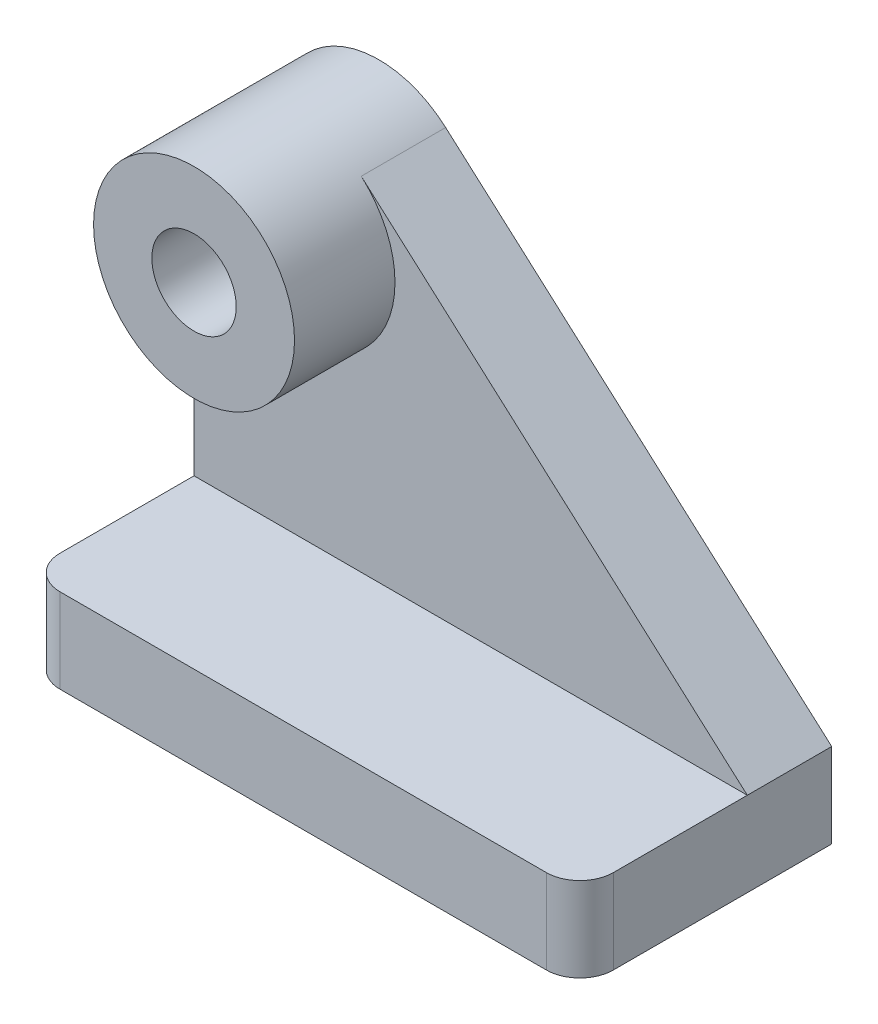
ISO-10303-21;
HEADER;
FILE_DESCRIPTION(('STEP AP214'),'2;1');
FILE_NAME('part.step','',(''),(''),'','','');
FILE_SCHEMA(('AUTOMOTIVE_DESIGN { 1 0 10303 214 1 1 1 1 }'));
ENDSEC;
DATA;
#1=APPLICATION_CONTEXT('core data for automotive mechanical design processes');
#2=APPLICATION_PROTOCOL_DEFINITION('international standard','automotive_design',2000,#1);
#3=PRODUCT_CONTEXT('',#1,'mechanical');
#4=PRODUCT('Part','Part','',(#3));
#5=PRODUCT_RELATED_PRODUCT_CATEGORY('part','',(#4));
#6=PRODUCT_DEFINITION_FORMATION('','',#4);
#7=PRODUCT_DEFINITION_CONTEXT('part definition',#1,'design');
#8=PRODUCT_DEFINITION('design','',#6,#7);
#9=PRODUCT_DEFINITION_SHAPE('','',#8);
#10=(LENGTH_UNIT() NAMED_UNIT(*) SI_UNIT(.MILLI.,.METRE.));
#11=(NAMED_UNIT(*) PLANE_ANGLE_UNIT() SI_UNIT($,.RADIAN.));
#12=(NAMED_UNIT(*) SI_UNIT($,.STERADIAN.) SOLID_ANGLE_UNIT());
#13=UNCERTAINTY_MEASURE_WITH_UNIT(LENGTH_MEASURE(1.E-05),#10,'distance_accuracy_value','');
#14=(GEOMETRIC_REPRESENTATION_CONTEXT(3) GLOBAL_UNCERTAINTY_ASSIGNED_CONTEXT((#13)) GLOBAL_UNIT_ASSIGNED_CONTEXT((#10,
#11,#12)) REPRESENTATION_CONTEXT('',''));
#15=CARTESIAN_POINT('',(0.,0.,0.));
#16=DIRECTION('',(0.,0.,1.));
#17=DIRECTION('',(1.,0.,0.));
#18=AXIS2_PLACEMENT_3D('',#15,#16,#17);
#19=CARTESIAN_POINT('',(25.8671785714286,85.852,11.6227678571429));
#20=DIRECTION('',(0.,0.,-1.));
#21=DIRECTION('',(-1.,0.,0.));
#22=AXIS2_PLACEMENT_3D('',#19,#20,#21);
#23=PLANE('',#22);
#24=CARTESIAN_POINT('',(-59.9848214285714,66.802,11.6227678571429));
#25=DIRECTION('',(0.,0.,1.));
#26=DIRECTION('',(1.,0.,0.));
#27=AXIS2_PLACEMENT_3D('',#24,#25,#26);
#28=CIRCLE('',#27,19.05);
#29=CARTESIAN_POINT('',(-79.0348214285714,66.802,11.6227678571429));
#30=VERTEX_POINT('',#29);
#31=CARTESIAN_POINT('',(-47.3313908986114,81.0425475956325,11.6227678571429));
#32=VERTEX_POINT('',#31);
#33=EDGE_CURVE('E111',#30,#32,#28,.T.);
#34=ORIENTED_EDGE('',*,*,#33,.F.);
#35=DIRECTION('',(0.,-1.,0.));
#36=VECTOR('',#35,1.);
#37=CARTESIAN_POINT('',(-79.0348214285714,85.852,11.6227678571429));
#38=LINE('',#37,#36);
#39=CARTESIAN_POINT('',(-79.0348214285714,16.002,11.6227678571429));
#40=VERTEX_POINT('',#39);
#41=EDGE_CURVE('E30',#30,#40,#38,.T.);
#42=ORIENTED_EDGE('',*,*,#41,.T.);
#43=DIRECTION('',(1.,0.,0.));
#44=VECTOR('',#43,1.);
#45=CARTESIAN_POINT('',(25.8671785714286,16.002,11.6227678571429));
#46=LINE('',#45,#44);
#47=CARTESIAN_POINT('',(25.8671785714286,16.002,11.6227678571429));
#48=VERTEX_POINT('',#47);
#49=EDGE_CURVE('E105',#40,#48,#46,.T.);
#50=ORIENTED_EDGE('',*,*,#49,.T.);
#51=DIRECTION('',(0.747535306857349,-0.66422207506352,0.));
#52=VECTOR('',#51,1.);
#53=CARTESIAN_POINT('',(27.9598031381194,14.142599622164,11.6227678571429));
#54=LINE('',#53,#52);
#55=EDGE_CURVE('E114',#32,#48,#54,.T.);
#56=ORIENTED_EDGE('',*,*,#55,.F.);
#57=EDGE_LOOP('',(#34,#42,#50,#56));
#58=FACE_BOUND('',#57,.T.);
#59=ADVANCED_FACE('F26',(#58),#23,.F.);
#60=CARTESIAN_POINT('',(-79.0348214285714,16.002,-4.37923214285713));
#61=DIRECTION('',(0.,0.,1.));
#62=DIRECTION('',(1.,0.,0.));
#63=AXIS2_PLACEMENT_3D('',#60,#61,#62);
#64=PLANE('',#63);
#65=CARTESIAN_POINT('',(-59.9848214285714,66.802,-4.37923214285713));
#66=DIRECTION('',(0.,0.,1.));
#67=DIRECTION('',(1.,0.,0.));
#68=AXIS2_PLACEMENT_3D('',#65,#66,#67);
#69=CIRCLE('',#68,8.001);
#70=CARTESIAN_POINT('',(-51.9838214285714,66.802,-4.37923214285713));
#71=VERTEX_POINT('',#70);
#72=EDGE_CURVE('E118',#71,#71,#69,.T.);
#73=ORIENTED_EDGE('',*,*,#72,.T.);
#74=EDGE_LOOP('',(#73));
#75=FACE_BOUND('',#74,.T.);
#76=DIRECTION('',(0.,-1.,0.));
#77=VECTOR('',#76,1.);
#78=CARTESIAN_POINT('',(-79.0348214285714,16.002,-4.37923214285713));
#79=LINE('',#78,#77);
#80=CARTESIAN_POINT('',(-79.0348214285714,66.802,-4.37923214285713));
#81=VERTEX_POINT('',#80);
#82=CARTESIAN_POINT('',(-79.0348214285714,0.,-4.37923214285713));
#83=VERTEX_POINT('',#82);
#84=EDGE_CURVE('E158',#81,#83,#79,.T.);
#85=ORIENTED_EDGE('',*,*,#84,.F.);
#86=CARTESIAN_POINT('',(-59.9848214285714,66.802,-4.37923214285713));
#87=DIRECTION('',(0.,0.,1.));
#88=DIRECTION('',(1.,0.,0.));
#89=AXIS2_PLACEMENT_3D('',#86,#87,#88);
#90=CIRCLE('',#89,19.05);
#91=CARTESIAN_POINT('',(-47.3313908986114,81.0425475956325,-4.37923214285713));
#92=VERTEX_POINT('',#91);
#93=EDGE_CURVE('E113',#92,#81,#90,.T.);
#94=ORIENTED_EDGE('',*,*,#93,.F.);
#95=DIRECTION('',(0.747535306857349,-0.66422207506352,0.));
#96=VECTOR('',#95,1.);
#97=CARTESIAN_POINT('',(-32.7530068179643,68.0889326475586,-4.37923214285713));
#98=LINE('',#97,#96);
#99=CARTESIAN_POINT('',(25.8671785714286,16.002,-4.37923214285713));
#100=VERTEX_POINT('',#99);
#101=EDGE_CURVE('E131',#92,#100,#98,.T.);
#102=ORIENTED_EDGE('',*,*,#101,.T.);
#103=DIRECTION('',(0.,-1.,0.));
#104=VECTOR('',#103,1.);
#105=CARTESIAN_POINT('',(25.8671785714285,16.002,-4.37923214285713));
#106=LINE('',#105,#104);
#107=CARTESIAN_POINT('',(25.8671785714285,0.,-4.37923214285713));
#108=VERTEX_POINT('',#107);
#109=EDGE_CURVE('E156',#100,#108,#106,.T.);
#110=ORIENTED_EDGE('',*,*,#109,.T.);
#111=DIRECTION('',(-1.,0.,0.));
#112=VECTOR('',#111,1.);
#113=CARTESIAN_POINT('',(-79.0348214285714,0.,-4.37923214285713));
#114=LINE('',#113,#112);
#115=EDGE_CURVE('E163',#108,#83,#114,.T.);
#116=ORIENTED_EDGE('',*,*,#115,.T.);
#117=EDGE_LOOP('',(#85,#94,#102,#110,#116));
#118=FACE_BOUND('',#117,.T.);
#119=ADVANCED_FACE('F202',(#75,#118),#64,.F.);
#120=CARTESIAN_POINT('',(-79.0348214285714,16.002,-4.37923214285713));
#121=DIRECTION('',(1.,0.,0.));
#122=DIRECTION('',(0.,0.,-1.));
#123=AXIS2_PLACEMENT_3D('',#120,#121,#122);
#124=PLANE('',#123);
#125=DIRECTION('',(0.,0.,1.));
#126=VECTOR('',#125,1.);
#127=CARTESIAN_POINT('',(-79.0348214285714,66.802,-188.029028832143));
#128=LINE('',#127,#126);
#129=EDGE_CURVE('E100',#81,#30,#128,.T.);
#130=ORIENTED_EDGE('',*,*,#129,.F.);
#131=ORIENTED_EDGE('',*,*,#84,.T.);
#132=DIRECTION('',(0.,0.,1.));
#133=VECTOR('',#132,1.);
#134=CARTESIAN_POINT('',(-79.0348214285714,0.,-4.37923214285713));
#135=LINE('',#134,#133);
#136=CARTESIAN_POINT('',(-79.0348214285714,0.,37.0227678571429));
#137=VERTEX_POINT('',#136);
#138=EDGE_CURVE('E104',#83,#137,#135,.T.);
#139=ORIENTED_EDGE('',*,*,#138,.T.);
#140=DIRECTION('',(0.,-1.,0.));
#141=VECTOR('',#140,1.);
#142=CARTESIAN_POINT('',(-79.0348214285714,16.002,37.0227678571429));
#143=LINE('',#142,#141);
#144=CARTESIAN_POINT('',(-79.0348214285714,16.002,37.0227678571429));
#145=VERTEX_POINT('',#144);
#146=EDGE_CURVE('E179',#137,#145,#143,.F.);
#147=ORIENTED_EDGE('',*,*,#146,.T.);
#148=DIRECTION('',(0.,0.,1.));
#149=VECTOR('',#148,1.);
#150=CARTESIAN_POINT('',(-79.0348214285714,16.002,-4.37923214285713));
#151=LINE('',#150,#149);
#152=EDGE_CURVE('E103',#40,#145,#151,.T.);
#153=ORIENTED_EDGE('',*,*,#152,.F.);
#154=ORIENTED_EDGE('',*,*,#41,.F.);
#155=EDGE_LOOP('',(#130,#131,#139,#147,#153,#154));
#156=FACE_BOUND('',#155,.T.);
#157=ADVANCED_FACE('F28',(#156),#124,.F.);
#158=CARTESIAN_POINT('',(-79.0348214285714,16.002,43.3727678571429));
#159=DIRECTION('',(0.,0.,-1.));
#160=DIRECTION('',(-1.,0.,0.));
#161=AXIS2_PLACEMENT_3D('',#158,#159,#160);
#162=PLANE('',#161);
#163=DIRECTION('',(1.,0.,0.));
#164=VECTOR('',#163,1.);
#165=CARTESIAN_POINT('',(-79.0348214285714,16.002,43.3727678571429));
#166=LINE('',#165,#164);
#167=CARTESIAN_POINT('',(-72.6848214285714,16.002,43.3727678571429));
#168=VERTEX_POINT('',#167);
#169=CARTESIAN_POINT('',(19.5171785714286,16.002,43.3727678571429));
#170=VERTEX_POINT('',#169);
#171=EDGE_CURVE('E159',#168,#170,#166,.T.);
#172=ORIENTED_EDGE('',*,*,#171,.F.);
#173=DIRECTION('',(0.,-1.,0.));
#174=VECTOR('',#173,1.);
#175=CARTESIAN_POINT('',(-72.6848214285714,16.002,43.3727678571429));
#176=LINE('',#175,#174);
#177=CARTESIAN_POINT('',(-72.6848214285714,0.,43.3727678571429));
#178=VERTEX_POINT('',#177);
#179=EDGE_CURVE('E172',#168,#178,#176,.T.);
#180=ORIENTED_EDGE('',*,*,#179,.T.);
#181=DIRECTION('',(1.,0.,0.));
#182=VECTOR('',#181,1.);
#183=CARTESIAN_POINT('',(-79.0348214285714,0.,43.3727678571429));
#184=LINE('',#183,#182);
#185=CARTESIAN_POINT('',(19.5171785714286,0.,43.3727678571429));
#186=VERTEX_POINT('',#185);
#187=EDGE_CURVE('E197',#178,#186,#184,.T.);
#188=ORIENTED_EDGE('',*,*,#187,.T.);
#189=DIRECTION('',(0.,-1.,0.));
#190=VECTOR('',#189,1.);
#191=CARTESIAN_POINT('',(19.5171785714286,16.002,43.3727678571429));
#192=LINE('',#191,#190);
#193=EDGE_CURVE('E170',#186,#170,#192,.F.);
#194=ORIENTED_EDGE('',*,*,#193,.T.);
#195=EDGE_LOOP('',(#172,#180,#188,#194));
#196=FACE_BOUND('',#195,.T.);
#197=ADVANCED_FACE('F187',(#196),#162,.F.);
#198=CARTESIAN_POINT('',(25.8671785714285,16.002,-4.37923214285713));
#199=DIRECTION('',(-1.,0.,0.));
#200=DIRECTION('',(0.,0.,1.));
#201=AXIS2_PLACEMENT_3D('',#198,#199,#200);
#202=PLANE('',#201);
#203=ORIENTED_EDGE('',*,*,#109,.F.);
#204=DIRECTION('',(0.,0.,1.));
#205=VECTOR('',#204,1.);
#206=CARTESIAN_POINT('',(25.8671785714286,16.002,-58.2272321428571));
#207=LINE('',#206,#205);
#208=EDGE_CURVE('E129',#100,#48,#207,.T.);
#209=ORIENTED_EDGE('',*,*,#208,.T.);
#210=DIRECTION('',(0.,0.,-1.));
#211=VECTOR('',#210,1.);
#212=CARTESIAN_POINT('',(25.8671785714285,16.002,-4.37923214285713));
#213=LINE('',#212,#211);
#214=CARTESIAN_POINT('',(25.8671785714286,16.002,37.0227678571429));
#215=VERTEX_POINT('',#214);
#216=EDGE_CURVE('E139',#215,#48,#213,.T.);
#217=ORIENTED_EDGE('',*,*,#216,.F.);
#218=DIRECTION('',(0.,-1.,0.));
#219=VECTOR('',#218,1.);
#220=CARTESIAN_POINT('',(25.8671785714286,16.002,37.0227678571429));
#221=LINE('',#220,#219);
#222=CARTESIAN_POINT('',(25.8671785714286,0.,37.0227678571429));
#223=VERTEX_POINT('',#222);
#224=EDGE_CURVE('E11',#215,#223,#221,.T.);
#225=ORIENTED_EDGE('',*,*,#224,.T.);
#226=DIRECTION('',(0.,0.,-1.));
#227=VECTOR('',#226,1.);
#228=CARTESIAN_POINT('',(25.8671785714285,0.,-4.37923214285713));
#229=LINE('',#228,#227);
#230=EDGE_CURVE('E199',#223,#108,#229,.T.);
#231=ORIENTED_EDGE('',*,*,#230,.T.);
#232=EDGE_LOOP('',(#203,#209,#217,#225,#231));
#233=FACE_BOUND('',#232,.T.);
#234=ADVANCED_FACE('F153',(#233),#202,.F.);
#235=CARTESIAN_POINT('',(-79.0348214285714,16.002,43.3727678571429));
#236=DIRECTION('',(0.,1.,0.));
#237=DIRECTION('',(0.,0.,1.));
#238=AXIS2_PLACEMENT_3D('',#235,#236,#237);
#239=PLANE('',#238);
#240=ORIENTED_EDGE('',*,*,#49,.F.);
#241=ORIENTED_EDGE('',*,*,#152,.T.);
#242=CARTESIAN_POINT('',(-72.6848214285714,16.002,37.0227678571429));
#243=DIRECTION('',(0.,1.,0.));
#244=DIRECTION('',(0.,0.,1.));
#245=AXIS2_PLACEMENT_3D('',#242,#243,#244);
#246=CIRCLE('',#245,6.35);
#247=EDGE_CURVE('E36',#145,#168,#246,.T.);
#248=ORIENTED_EDGE('',*,*,#247,.T.);
#249=ORIENTED_EDGE('',*,*,#171,.T.);
#250=CARTESIAN_POINT('',(19.5171785714286,16.002,37.0227678571429));
#251=DIRECTION('',(0.,1.,0.));
#252=DIRECTION('',(0.,0.,1.));
#253=AXIS2_PLACEMENT_3D('',#250,#251,#252);
#254=CIRCLE('',#253,6.35);
#255=EDGE_CURVE('E51',#170,#215,#254,.T.);
#256=ORIENTED_EDGE('',*,*,#255,.T.);
#257=ORIENTED_EDGE('',*,*,#216,.T.);
#258=EDGE_LOOP('',(#240,#241,#248,#249,#256,#257));
#259=FACE_BOUND('',#258,.T.);
#260=ADVANCED_FACE('F157',(#259),#239,.T.);
#261=CARTESIAN_POINT('',(-79.0348214285714,0.,43.3727678571429));
#262=DIRECTION('',(0.,1.,0.));
#263=DIRECTION('',(0.,0.,1.));
#264=AXIS2_PLACEMENT_3D('',#261,#262,#263);
#265=PLANE('',#264);
#266=ORIENTED_EDGE('',*,*,#187,.F.);
#267=CARTESIAN_POINT('',(-72.6848214285714,0.,37.0227678571429));
#268=DIRECTION('',(0.,1.,0.));
#269=DIRECTION('',(0.,0.,1.));
#270=AXIS2_PLACEMENT_3D('',#267,#268,#269);
#271=CIRCLE('',#270,6.35);
#272=EDGE_CURVE('E177',#178,#137,#271,.F.);
#273=ORIENTED_EDGE('',*,*,#272,.T.);
#274=ORIENTED_EDGE('',*,*,#138,.F.);
#275=ORIENTED_EDGE('',*,*,#115,.F.);
#276=ORIENTED_EDGE('',*,*,#230,.F.);
#277=CARTESIAN_POINT('',(19.5171785714286,0.,37.0227678571429));
#278=DIRECTION('',(0.,1.,0.));
#279=DIRECTION('',(0.,0.,1.));
#280=AXIS2_PLACEMENT_3D('',#277,#278,#279);
#281=CIRCLE('',#280,6.35);
#282=EDGE_CURVE('E175',#223,#186,#281,.F.);
#283=ORIENTED_EDGE('',*,*,#282,.T.);
#284=EDGE_LOOP('',(#266,#273,#274,#275,#276,#283));
#285=FACE_BOUND('',#284,.T.);
#286=ADVANCED_FACE('F195',(#285),#265,.F.);
#287=CARTESIAN_POINT('',(-72.6848214285714,16.002,37.0227678571429));
#288=DIRECTION('',(0.,-1.,0.));
#289=DIRECTION('',(0.,0.,-1.));
#290=AXIS2_PLACEMENT_3D('',#287,#288,#289);
#291=CYLINDRICAL_SURFACE('',#290,6.35);
#292=ORIENTED_EDGE('',*,*,#247,.F.);
#293=ORIENTED_EDGE('',*,*,#146,.F.);
#294=ORIENTED_EDGE('',*,*,#272,.F.);
#295=ORIENTED_EDGE('',*,*,#179,.F.);
#296=EDGE_LOOP('',(#292,#293,#294,#295));
#297=FACE_BOUND('',#296,.T.);
#298=ADVANCED_FACE('F191',(#297),#291,.T.);
#299=CARTESIAN_POINT('',(19.5171785714286,16.002,37.0227678571429));
#300=DIRECTION('',(0.,-1.,0.));
#301=DIRECTION('',(0.,0.,-1.));
#302=AXIS2_PLACEMENT_3D('',#299,#300,#301);
#303=CYLINDRICAL_SURFACE('',#302,6.35);
#304=ORIENTED_EDGE('',*,*,#255,.F.);
#305=ORIENTED_EDGE('',*,*,#193,.F.);
#306=ORIENTED_EDGE('',*,*,#282,.F.);
#307=ORIENTED_EDGE('',*,*,#224,.F.);
#308=EDGE_LOOP('',(#304,#305,#306,#307));
#309=FACE_BOUND('',#308,.T.);
#310=ADVANCED_FACE('F205',(#309),#303,.T.);
#311=CARTESIAN_POINT('',(27.9598031381194,14.142599622164,-58.2272321428571));
#312=DIRECTION('',(-0.66422207506352,-0.747535306857349,0.));
#313=DIRECTION('',(0.747535306857349,-0.66422207506352,0.));
#314=AXIS2_PLACEMENT_3D('',#311,#312,#313);
#315=PLANE('',#314);
#316=DIRECTION('',(0.,0.,1.));
#317=VECTOR('',#316,1.);
#318=CARTESIAN_POINT('',(-47.3313908986114,81.0425475956325,-58.2272321428571));
#319=LINE('',#318,#317);
#320=EDGE_CURVE('E127',#92,#32,#319,.T.);
#321=ORIENTED_EDGE('',*,*,#320,.T.);
#322=ORIENTED_EDGE('',*,*,#55,.T.);
#323=ORIENTED_EDGE('',*,*,#208,.F.);
#324=ORIENTED_EDGE('',*,*,#101,.F.);
#325=EDGE_LOOP('',(#321,#322,#323,#324));
#326=FACE_BOUND('',#325,.T.);
#327=ADVANCED_FACE('F150',(#326),#315,.F.);
#328=CARTESIAN_POINT('',(-59.9848214285714,66.802,-58.2272321428571));
#329=DIRECTION('',(0.,0.,1.));
#330=DIRECTION('',(1.,0.,0.));
#331=AXIS2_PLACEMENT_3D('',#328,#329,#330);
#332=CYLINDRICAL_SURFACE('',#331,19.05);
#333=ORIENTED_EDGE('',*,*,#93,.T.);
#334=ORIENTED_EDGE('',*,*,#129,.T.);
#335=ORIENTED_EDGE('',*,*,#33,.T.);
#336=ORIENTED_EDGE('',*,*,#320,.F.);
#337=EDGE_LOOP('',(#333,#334,#335,#336));
#338=FACE_BOUND('',#337,.T.);
#339=CARTESIAN_POINT('',(-59.9848214285714,66.802,30.6727678571429));
#340=DIRECTION('',(0.,0.,1.));
#341=DIRECTION('',(1.,0.,0.));
#342=AXIS2_PLACEMENT_3D('',#339,#340,#341);
#343=CIRCLE('',#342,19.05);
#344=CARTESIAN_POINT('',(-40.9348214285714,66.802,30.6727678571429));
#345=VERTEX_POINT('',#344);
#346=EDGE_CURVE('E115',#345,#345,#343,.T.);
#347=ORIENTED_EDGE('',*,*,#346,.F.);
#348=EDGE_LOOP('',(#347));
#349=FACE_BOUND('',#348,.T.);
#350=ADVANCED_FACE('F108',(#338,#349),#332,.T.);
#351=CARTESIAN_POINT('',(-59.9848214285714,66.802,30.6727678571429));
#352=DIRECTION('',(0.,0.,1.));
#353=DIRECTION('',(1.,0.,0.));
#354=AXIS2_PLACEMENT_3D('',#351,#352,#353);
#355=PLANE('',#354);
#356=CARTESIAN_POINT('',(-59.9848214285714,66.802,30.6727678571429));
#357=DIRECTION('',(0.,0.,1.));
#358=DIRECTION('',(1.,0.,0.));
#359=AXIS2_PLACEMENT_3D('',#356,#357,#358);
#360=CIRCLE('',#359,8.001);
#361=CARTESIAN_POINT('',(-51.9838214285714,66.802,30.6727678571429));
#362=VERTEX_POINT('',#361);
#363=EDGE_CURVE('E123',#362,#362,#360,.T.);
#364=ORIENTED_EDGE('',*,*,#363,.F.);
#365=EDGE_LOOP('',(#364));
#366=FACE_BOUND('',#365,.T.);
#367=ORIENTED_EDGE('',*,*,#346,.T.);
#368=EDGE_LOOP('',(#367));
#369=FACE_BOUND('',#368,.T.);
#370=ADVANCED_FACE('F225',(#366,#369),#355,.T.);
#371=CARTESIAN_POINT('',(-59.9848214285714,66.802,-4.37925714285713));
#372=DIRECTION('',(0.,0.,1.));
#373=DIRECTION('',(1.,0.,0.));
#374=AXIS2_PLACEMENT_3D('',#371,#372,#373);
#375=CYLINDRICAL_SURFACE('',#374,8.001);
#376=ORIENTED_EDGE('',*,*,#363,.T.);
#377=EDGE_LOOP('',(#376));
#378=FACE_BOUND('',#377,.T.);
#379=ORIENTED_EDGE('',*,*,#72,.F.);
#380=EDGE_LOOP('',(#379));
#381=FACE_BOUND('',#380,.T.);
#382=ADVANCED_FACE('F229',(#378,#381),#375,.F.);
#383=CLOSED_SHELL('',(#59,#119,#157,#197,#234,#260,#286,#298,#310,#327,#350,#370,#382));
#384=MANIFOLD_SOLID_BREP('B2',#383);
#385=ADVANCED_BREP_SHAPE_REPRESENTATION('',(#18,#384),#14);
#386=SHAPE_DEFINITION_REPRESENTATION(#9,#385);
ENDSEC;
END-ISO-10303-21;
